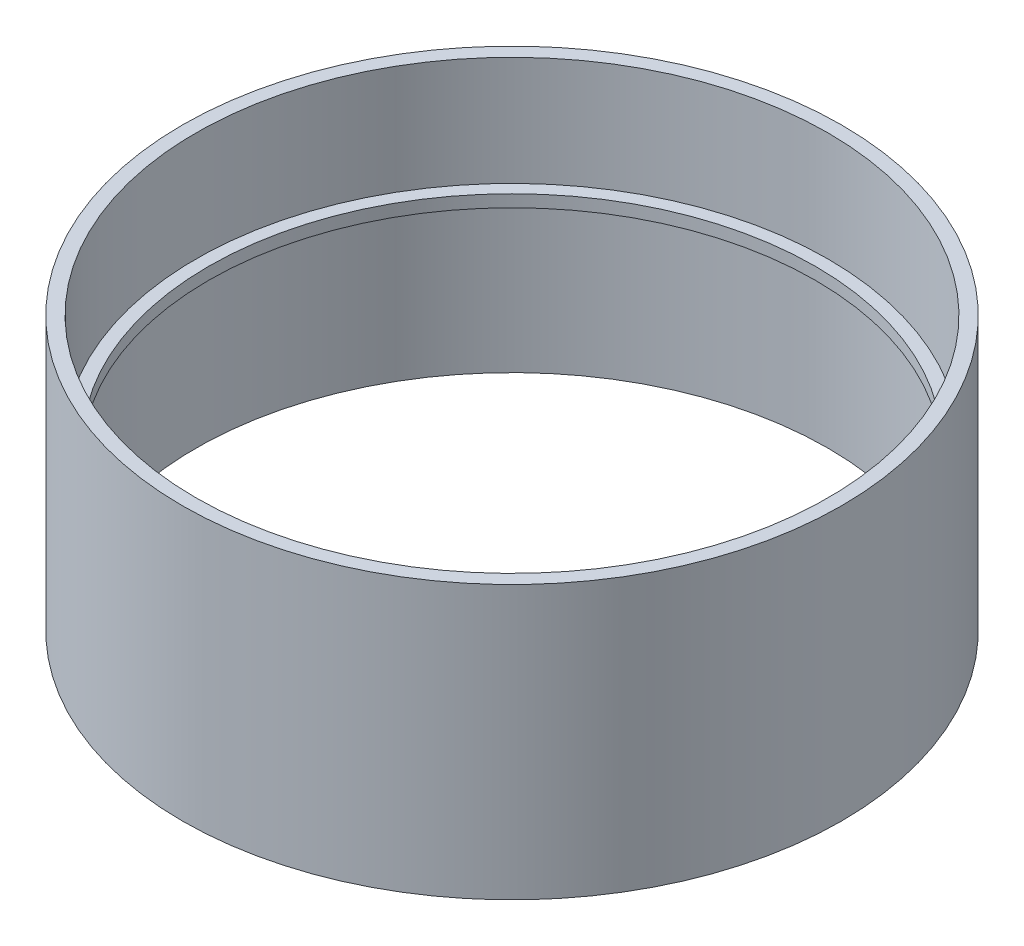
ISO-10303-21;
HEADER;
FILE_DESCRIPTION(('STEP AP214'),'2;1');
FILE_NAME('part.step','',(''),(''),'','','');
FILE_SCHEMA(('AUTOMOTIVE_DESIGN { 1 0 10303 214 1 1 1 1 }'));
ENDSEC;
DATA;
#1=APPLICATION_CONTEXT('core data for automotive mechanical design processes');
#2=APPLICATION_PROTOCOL_DEFINITION('international standard','automotive_design',2000,#1);
#3=PRODUCT_CONTEXT('',#1,'mechanical');
#4=PRODUCT('Part','Part','',(#3));
#5=PRODUCT_RELATED_PRODUCT_CATEGORY('part','',(#4));
#6=PRODUCT_DEFINITION_FORMATION('','',#4);
#7=PRODUCT_DEFINITION_CONTEXT('part definition',#1,'design');
#8=PRODUCT_DEFINITION('design','',#6,#7);
#9=PRODUCT_DEFINITION_SHAPE('','',#8);
#10=(LENGTH_UNIT() NAMED_UNIT(*) SI_UNIT(.MILLI.,.METRE.));
#11=(NAMED_UNIT(*) PLANE_ANGLE_UNIT() SI_UNIT($,.RADIAN.));
#12=(NAMED_UNIT(*) SI_UNIT($,.STERADIAN.) SOLID_ANGLE_UNIT());
#13=UNCERTAINTY_MEASURE_WITH_UNIT(LENGTH_MEASURE(1.E-05),#10,'distance_accuracy_value','');
#14=(GEOMETRIC_REPRESENTATION_CONTEXT(3) GLOBAL_UNCERTAINTY_ASSIGNED_CONTEXT((#13)) GLOBAL_UNIT_ASSIGNED_CONTEXT((#10,
#11,#12)) REPRESENTATION_CONTEXT('',''));
#15=CARTESIAN_POINT('',(0.,0.,0.));
#16=DIRECTION('',(0.,0.,1.));
#17=DIRECTION('',(1.,0.,0.));
#18=AXIS2_PLACEMENT_3D('',#15,#16,#17);
#19=CARTESIAN_POINT('',(41.402,0.,0.));
#20=DIRECTION('',(0.,-1.,0.));
#21=DIRECTION('',(0.,0.,-1.));
#22=AXIS2_PLACEMENT_3D('',#19,#20,#21);
#23=PLANE('',#22);
#24=CARTESIAN_POINT('',(0.,0.,0.));
#25=DIRECTION('',(0.,-1.,0.));
#26=DIRECTION('',(0.,0.,-1.));
#27=AXIS2_PLACEMENT_3D('',#24,#25,#26);
#28=CIRCLE('',#27,41.402);
#29=CARTESIAN_POINT('',(0.,0.,-41.402));
#30=VERTEX_POINT('',#29);
#31=EDGE_CURVE('E62',#30,#30,#28,.T.);
#32=ORIENTED_EDGE('',*,*,#31,.T.);
#33=EDGE_LOOP('',(#32));
#34=FACE_BOUND('',#33,.T.);
#35=CARTESIAN_POINT('',(0.,0.,0.));
#36=DIRECTION('',(0.,-1.,0.));
#37=DIRECTION('',(0.,0.,-1.));
#38=AXIS2_PLACEMENT_3D('',#35,#36,#37);
#39=CIRCLE('',#38,39.6875);
#40=CARTESIAN_POINT('',(0.,0.,-39.6875));
#41=VERTEX_POINT('',#40);
#42=EDGE_CURVE('E10',#41,#41,#39,.T.);
#43=ORIENTED_EDGE('',*,*,#42,.F.);
#44=EDGE_LOOP('',(#43));
#45=FACE_BOUND('',#44,.T.);
#46=ADVANCED_FACE('F34',(#34,#45),#23,.T.);
#47=CARTESIAN_POINT('',(0.,0.,0.));
#48=DIRECTION('',(0.,-1.,0.));
#49=DIRECTION('',(0.,0.,-1.));
#50=AXIS2_PLACEMENT_3D('',#47,#48,#49);
#51=CYLINDRICAL_SURFACE('',#50,39.6875);
#52=ORIENTED_EDGE('',*,*,#42,.T.);
#53=EDGE_LOOP('',(#52));
#54=FACE_BOUND('',#53,.T.);
#55=CARTESIAN_POINT('',(0.,19.05,0.));
#56=DIRECTION('',(0.,-1.,0.));
#57=DIRECTION('',(0.,0.,-1.));
#58=AXIS2_PLACEMENT_3D('',#55,#56,#57);
#59=CIRCLE('',#58,39.6875);
#60=CARTESIAN_POINT('',(0.,19.05,-39.6875));
#61=VERTEX_POINT('',#60);
#62=EDGE_CURVE('E40',#61,#61,#59,.T.);
#63=ORIENTED_EDGE('',*,*,#62,.F.);
#64=EDGE_LOOP('',(#63));
#65=FACE_BOUND('',#64,.T.);
#66=ADVANCED_FACE('F80',(#54,#65),#51,.F.);
#67=CARTESIAN_POINT('',(39.6875,19.05,0.));
#68=DIRECTION('',(0.,-1.,0.));
#69=DIRECTION('',(0.,0.,-1.));
#70=AXIS2_PLACEMENT_3D('',#67,#68,#69);
#71=PLANE('',#70);
#72=ORIENTED_EDGE('',*,*,#62,.T.);
#73=EDGE_LOOP('',(#72));
#74=FACE_BOUND('',#73,.T.);
#75=CARTESIAN_POINT('',(0.,19.05,0.));
#76=DIRECTION('',(0.,-1.,0.));
#77=DIRECTION('',(0.,0.,-1.));
#78=AXIS2_PLACEMENT_3D('',#75,#76,#77);
#79=CIRCLE('',#78,38.1);
#80=CARTESIAN_POINT('',(0.,19.05,-38.1));
#81=VERTEX_POINT('',#80);
#82=EDGE_CURVE('E44',#81,#81,#79,.T.);
#83=ORIENTED_EDGE('',*,*,#82,.F.);
#84=EDGE_LOOP('',(#83));
#85=FACE_BOUND('',#84,.T.);
#86=ADVANCED_FACE('F84',(#74,#85),#71,.T.);
#87=CARTESIAN_POINT('',(0.,0.,0.));
#88=DIRECTION('',(0.,-1.,0.));
#89=DIRECTION('',(0.,0.,-1.));
#90=AXIS2_PLACEMENT_3D('',#87,#88,#89);
#91=CYLINDRICAL_SURFACE('',#90,38.1);
#92=ORIENTED_EDGE('',*,*,#82,.T.);
#93=EDGE_LOOP('',(#92));
#94=FACE_BOUND('',#93,.T.);
#95=CARTESIAN_POINT('',(0.,20.574,0.));
#96=DIRECTION('',(0.,-1.,0.));
#97=DIRECTION('',(0.,0.,-1.));
#98=AXIS2_PLACEMENT_3D('',#95,#96,#97);
#99=CIRCLE('',#98,38.1);
#100=CARTESIAN_POINT('',(0.,20.574,-38.1));
#101=VERTEX_POINT('',#100);
#102=EDGE_CURVE('E48',#101,#101,#99,.T.);
#103=ORIENTED_EDGE('',*,*,#102,.F.);
#104=EDGE_LOOP('',(#103));
#105=FACE_BOUND('',#104,.T.);
#106=ADVANCED_FACE('F88',(#94,#105),#91,.F.);
#107=CARTESIAN_POINT('',(38.1,20.574,0.));
#108=DIRECTION('',(0.,1.,0.));
#109=DIRECTION('',(0.,0.,1.));
#110=AXIS2_PLACEMENT_3D('',#107,#108,#109);
#111=PLANE('',#110);
#112=ORIENTED_EDGE('',*,*,#102,.T.);
#113=EDGE_LOOP('',(#112));
#114=FACE_BOUND('',#113,.T.);
#115=CARTESIAN_POINT('',(0.,20.574,0.));
#116=DIRECTION('',(0.,-1.,0.));
#117=DIRECTION('',(0.,0.,-1.));
#118=AXIS2_PLACEMENT_3D('',#115,#116,#117);
#119=CIRCLE('',#118,39.6875);
#120=CARTESIAN_POINT('',(0.,20.574,-39.6875));
#121=VERTEX_POINT('',#120);
#122=EDGE_CURVE('E53',#121,#121,#119,.T.);
#123=ORIENTED_EDGE('',*,*,#122,.F.);
#124=EDGE_LOOP('',(#123));
#125=FACE_BOUND('',#124,.T.);
#126=ADVANCED_FACE('F94',(#114,#125),#111,.T.);
#127=CARTESIAN_POINT('',(0.,0.,0.));
#128=DIRECTION('',(0.,-1.,0.));
#129=DIRECTION('',(0.,0.,-1.));
#130=AXIS2_PLACEMENT_3D('',#127,#128,#129);
#131=CYLINDRICAL_SURFACE('',#130,39.6875);
#132=ORIENTED_EDGE('',*,*,#122,.T.);
#133=EDGE_LOOP('',(#132));
#134=FACE_BOUND('',#133,.T.);
#135=CARTESIAN_POINT('',(0.,34.29,0.));
#136=DIRECTION('',(0.,-1.,0.));
#137=DIRECTION('',(0.,0.,-1.));
#138=AXIS2_PLACEMENT_3D('',#135,#136,#137);
#139=CIRCLE('',#138,39.6875);
#140=CARTESIAN_POINT('',(0.,34.29,-39.6875));
#141=VERTEX_POINT('',#140);
#142=EDGE_CURVE('E56',#141,#141,#139,.T.);
#143=ORIENTED_EDGE('',*,*,#142,.F.);
#144=EDGE_LOOP('',(#143));
#145=FACE_BOUND('',#144,.T.);
#146=ADVANCED_FACE('F76',(#134,#145),#131,.F.);
#147=CARTESIAN_POINT('',(39.6875,34.29,0.));
#148=DIRECTION('',(0.,1.,0.));
#149=DIRECTION('',(0.,0.,1.));
#150=AXIS2_PLACEMENT_3D('',#147,#148,#149);
#151=PLANE('',#150);
#152=ORIENTED_EDGE('',*,*,#142,.T.);
#153=EDGE_LOOP('',(#152));
#154=FACE_BOUND('',#153,.T.);
#155=CARTESIAN_POINT('',(0.,34.29,0.));
#156=DIRECTION('',(0.,-1.,0.));
#157=DIRECTION('',(0.,0.,-1.));
#158=AXIS2_PLACEMENT_3D('',#155,#156,#157);
#159=CIRCLE('',#158,41.402);
#160=CARTESIAN_POINT('',(0.,34.29,-41.402));
#161=VERTEX_POINT('',#160);
#162=EDGE_CURVE('E59',#161,#161,#159,.T.);
#163=ORIENTED_EDGE('',*,*,#162,.F.);
#164=EDGE_LOOP('',(#163));
#165=FACE_BOUND('',#164,.T.);
#166=ADVANCED_FACE('F70',(#154,#165),#151,.T.);
#167=CARTESIAN_POINT('',(0.,0.,0.));
#168=DIRECTION('',(0.,-1.,0.));
#169=DIRECTION('',(0.,0.,-1.));
#170=AXIS2_PLACEMENT_3D('',#167,#168,#169);
#171=CYLINDRICAL_SURFACE('',#170,41.402);
#172=ORIENTED_EDGE('',*,*,#162,.T.);
#173=EDGE_LOOP('',(#172));
#174=FACE_BOUND('',#173,.T.);
#175=ORIENTED_EDGE('',*,*,#31,.F.);
#176=EDGE_LOOP('',(#175));
#177=FACE_BOUND('',#176,.T.);
#178=ADVANCED_FACE('F68',(#174,#177),#171,.T.);
#179=CLOSED_SHELL('',(#46,#66,#86,#106,#126,#146,#166,#178));
#180=MANIFOLD_SOLID_BREP('B2',#179);
#181=ADVANCED_BREP_SHAPE_REPRESENTATION('',(#18,#180),#14);
#182=SHAPE_DEFINITION_REPRESENTATION(#9,#181);
ENDSEC;
END-ISO-10303-21;
